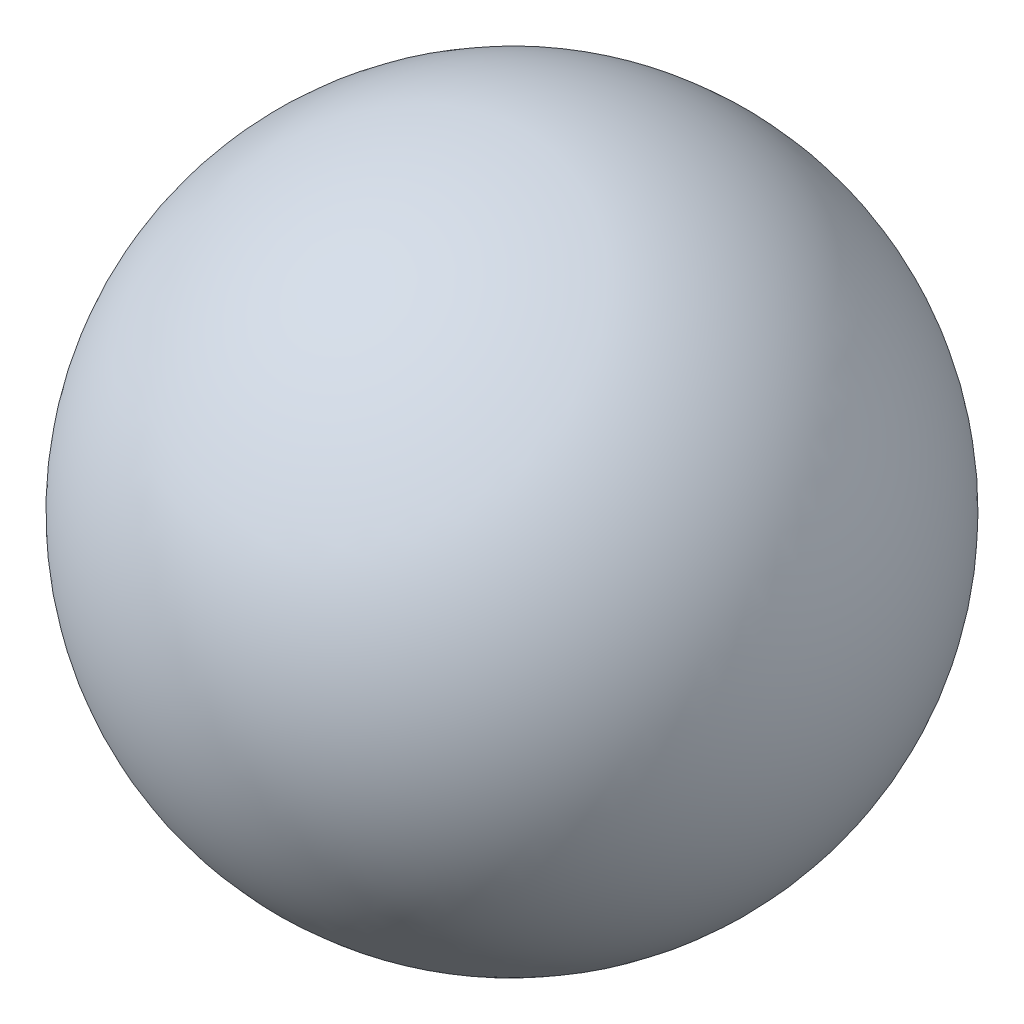
ISO-10303-21;
HEADER;
FILE_DESCRIPTION(('STEP AP214'),'2;1');
FILE_NAME('part.step','',(''),(''),'','','');
FILE_SCHEMA(('AUTOMOTIVE_DESIGN { 1 0 10303 214 1 1 1 1 }'));
ENDSEC;
DATA;
#1=APPLICATION_CONTEXT('core data for automotive mechanical design processes');
#2=APPLICATION_PROTOCOL_DEFINITION('international standard','automotive_design',2000,#1);
#3=PRODUCT_CONTEXT('',#1,'mechanical');
#4=PRODUCT('Part','Part','',(#3));
#5=PRODUCT_RELATED_PRODUCT_CATEGORY('part','',(#4));
#6=PRODUCT_DEFINITION_FORMATION('','',#4);
#7=PRODUCT_DEFINITION_CONTEXT('part definition',#1,'design');
#8=PRODUCT_DEFINITION('design','',#6,#7);
#9=PRODUCT_DEFINITION_SHAPE('','',#8);
#10=(LENGTH_UNIT() NAMED_UNIT(*) SI_UNIT(.MILLI.,.METRE.));
#11=(NAMED_UNIT(*) PLANE_ANGLE_UNIT() SI_UNIT($,.RADIAN.));
#12=(NAMED_UNIT(*) SI_UNIT($,.STERADIAN.) SOLID_ANGLE_UNIT());
#13=UNCERTAINTY_MEASURE_WITH_UNIT(LENGTH_MEASURE(1.E-05),#10,'distance_accuracy_value','');
#14=(GEOMETRIC_REPRESENTATION_CONTEXT(3) GLOBAL_UNCERTAINTY_ASSIGNED_CONTEXT((#13)) GLOBAL_UNIT_ASSIGNED_CONTEXT((#10,
#11,#12)) REPRESENTATION_CONTEXT('',''));
#15=CARTESIAN_POINT('',(0.,0.,0.));
#16=DIRECTION('',(0.,0.,1.));
#17=DIRECTION('',(1.,0.,0.));
#18=AXIS2_PLACEMENT_3D('',#15,#16,#17);
#19=CARTESIAN_POINT('',(-5.90884651807324,1.041889066001,2.00000000000003));
#20=DIRECTION('',(0.173648177666943,0.984807753012206,0.));
#21=DIRECTION('',(0.,0.,-1.));
#22=AXIS2_PLACEMENT_3D('',#19,#20,#21);
#23=SPHERICAL_SURFACE('',#22,1.04);
#24=CARTESIAN_POINT('',(-6.08944062284686,0.0176890028683058,2.00000000000003));
#25=VERTEX_POINT('',#24);
#26=VERTEX_LOOP('',#25);
#27=FACE_BOUND('',#26,.T.);
#28=ADVANCED_FACE('F15',(#27),#23,.T.);
#29=CLOSED_SHELL('',(#28));
#30=MANIFOLD_SOLID_BREP('B1',#29);
#31=ADVANCED_BREP_SHAPE_REPRESENTATION('',(#18,#30),#14);
#32=SHAPE_DEFINITION_REPRESENTATION(#9,#31);
ENDSEC;
END-ISO-10303-21;
